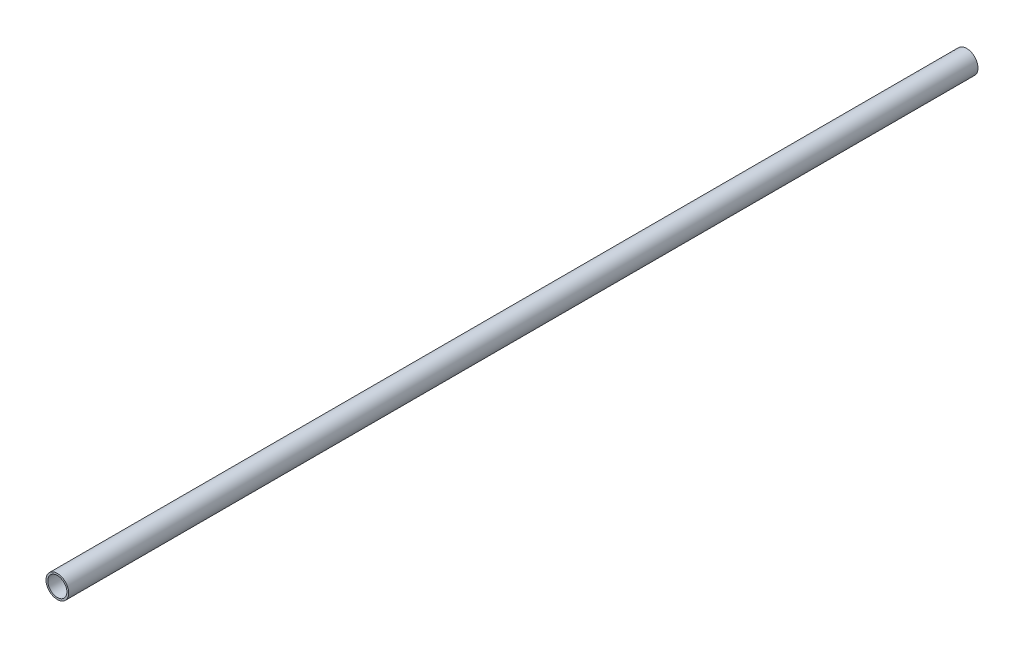
ISO-10303-21;
HEADER;
FILE_DESCRIPTION(('STEP AP214'),'2;1');
FILE_NAME('part.step','',(''),(''),'','','');
FILE_SCHEMA(('AUTOMOTIVE_DESIGN { 1 0 10303 214 1 1 1 1 }'));
ENDSEC;
DATA;
#1=APPLICATION_CONTEXT('core data for automotive mechanical design processes');
#2=APPLICATION_PROTOCOL_DEFINITION('international standard','automotive_design',2000,#1);
#3=PRODUCT_CONTEXT('',#1,'mechanical');
#4=PRODUCT('Part','Part','',(#3));
#5=PRODUCT_RELATED_PRODUCT_CATEGORY('part','',(#4));
#6=PRODUCT_DEFINITION_FORMATION('','',#4);
#7=PRODUCT_DEFINITION_CONTEXT('part definition',#1,'design');
#8=PRODUCT_DEFINITION('design','',#6,#7);
#9=PRODUCT_DEFINITION_SHAPE('','',#8);
#10=(LENGTH_UNIT() NAMED_UNIT(*) SI_UNIT(.MILLI.,.METRE.));
#11=(NAMED_UNIT(*) PLANE_ANGLE_UNIT() SI_UNIT($,.RADIAN.));
#12=(NAMED_UNIT(*) SI_UNIT($,.STERADIAN.) SOLID_ANGLE_UNIT());
#13=UNCERTAINTY_MEASURE_WITH_UNIT(LENGTH_MEASURE(1.E-05),#10,'distance_accuracy_value','');
#14=(GEOMETRIC_REPRESENTATION_CONTEXT(3) GLOBAL_UNCERTAINTY_ASSIGNED_CONTEXT((#13)) GLOBAL_UNIT_ASSIGNED_CONTEXT((#10,
#11,#12)) REPRESENTATION_CONTEXT('',''));
#15=CARTESIAN_POINT('',(0.,0.,0.));
#16=DIRECTION('',(0.,0.,1.));
#17=DIRECTION('',(1.,0.,0.));
#18=AXIS2_PLACEMENT_3D('',#15,#16,#17);
#19=CARTESIAN_POINT('',(0.,0.,-1000.));
#20=DIRECTION('',(0.,0.,-1.));
#21=DIRECTION('',(1.,0.,0.));
#22=AXIS2_PLACEMENT_3D('',#19,#20,#21);
#23=PLANE('',#22);
#24=CARTESIAN_POINT('',(0.,0.,-1000.));
#25=DIRECTION('',(0.,0.,1.));
#26=DIRECTION('',(1.,0.,0.));
#27=AXIS2_PLACEMENT_3D('',#24,#25,#26);
#28=CIRCLE('',#27,12.5);
#29=CARTESIAN_POINT('',(12.5,0.,-1000.));
#30=VERTEX_POINT('',#29);
#31=EDGE_CURVE('E10',#30,#30,#28,.T.);
#32=ORIENTED_EDGE('',*,*,#31,.F.);
#33=EDGE_LOOP('',(#32));
#34=FACE_BOUND('',#33,.T.);
#35=CARTESIAN_POINT('',(0.,0.,-1000.));
#36=DIRECTION('',(0.,0.,1.));
#37=DIRECTION('',(1.,0.,0.));
#38=AXIS2_PLACEMENT_3D('',#35,#36,#37);
#39=CIRCLE('',#38,10.5);
#40=CARTESIAN_POINT('',(10.5,0.,-1000.));
#41=VERTEX_POINT('',#40);
#42=EDGE_CURVE('E48',#41,#41,#39,.T.);
#43=ORIENTED_EDGE('',*,*,#42,.T.);
#44=EDGE_LOOP('',(#43));
#45=FACE_BOUND('',#44,.T.);
#46=ADVANCED_FACE('F37',(#34,#45),#23,.T.);
#47=CARTESIAN_POINT('',(0.,0.,0.));
#48=DIRECTION('',(0.,0.,-1.));
#49=DIRECTION('',(1.,0.,0.));
#50=AXIS2_PLACEMENT_3D('',#47,#48,#49);
#51=PLANE('',#50);
#52=CARTESIAN_POINT('',(0.,0.,0.));
#53=DIRECTION('',(0.,0.,1.));
#54=DIRECTION('',(1.,0.,0.));
#55=AXIS2_PLACEMENT_3D('',#52,#53,#54);
#56=CIRCLE('',#55,12.5);
#57=CARTESIAN_POINT('',(12.5,0.,0.));
#58=VERTEX_POINT('',#57);
#59=EDGE_CURVE('E41',#58,#58,#56,.T.);
#60=ORIENTED_EDGE('',*,*,#59,.T.);
#61=EDGE_LOOP('',(#60));
#62=FACE_BOUND('',#61,.T.);
#63=CARTESIAN_POINT('',(0.,0.,0.));
#64=DIRECTION('',(0.,0.,1.));
#65=DIRECTION('',(1.,0.,0.));
#66=AXIS2_PLACEMENT_3D('',#63,#64,#65);
#67=CIRCLE('',#66,10.5);
#68=CARTESIAN_POINT('',(10.5,0.,0.));
#69=VERTEX_POINT('',#68);
#70=EDGE_CURVE('E50',#69,#69,#67,.T.);
#71=ORIENTED_EDGE('',*,*,#70,.F.);
#72=EDGE_LOOP('',(#71));
#73=FACE_BOUND('',#72,.T.);
#74=ADVANCED_FACE('F63',(#62,#73),#51,.F.);
#75=CARTESIAN_POINT('',(0.,0.,-1000.));
#76=DIRECTION('',(0.,0.,1.));
#77=DIRECTION('',(-1.,0.,0.));
#78=AXIS2_PLACEMENT_3D('',#75,#76,#77);
#79=CYLINDRICAL_SURFACE('',#78,12.5);
#80=ORIENTED_EDGE('',*,*,#31,.T.);
#81=EDGE_LOOP('',(#80));
#82=FACE_BOUND('',#81,.T.);
#83=ORIENTED_EDGE('',*,*,#59,.F.);
#84=EDGE_LOOP('',(#83));
#85=FACE_BOUND('',#84,.T.);
#86=ADVANCED_FACE('F39',(#82,#85),#79,.T.);
#87=CARTESIAN_POINT('',(0.,0.,-1000.));
#88=DIRECTION('',(0.,0.,1.));
#89=DIRECTION('',(-1.,0.,0.));
#90=AXIS2_PLACEMENT_3D('',#87,#88,#89);
#91=CYLINDRICAL_SURFACE('',#90,10.5);
#92=ORIENTED_EDGE('',*,*,#42,.F.);
#93=EDGE_LOOP('',(#92));
#94=FACE_BOUND('',#93,.T.);
#95=ORIENTED_EDGE('',*,*,#70,.T.);
#96=EDGE_LOOP('',(#95));
#97=FACE_BOUND('',#96,.T.);
#98=ADVANCED_FACE('F57',(#94,#97),#91,.F.);
#99=CLOSED_SHELL('',(#46,#74,#86,#98));
#100=MANIFOLD_SOLID_BREP('B2',#99);
#101=ADVANCED_BREP_SHAPE_REPRESENTATION('',(#18,#100),#14);
#102=SHAPE_DEFINITION_REPRESENTATION(#9,#101);
ENDSEC;
END-ISO-10303-21;
